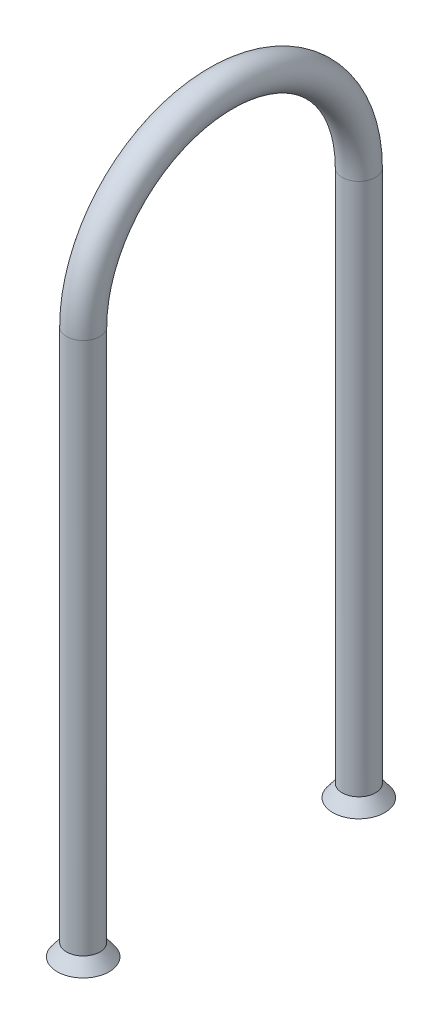
ISO-10303-21;
HEADER;
FILE_DESCRIPTION(('STEP AP214'),'2;1');
FILE_NAME('part.step','',(''),(''),'','','');
FILE_SCHEMA(('AUTOMOTIVE_DESIGN { 1 0 10303 214 1 1 1 1 }'));
ENDSEC;
DATA;
#1=APPLICATION_CONTEXT('core data for automotive mechanical design processes');
#2=APPLICATION_PROTOCOL_DEFINITION('international standard','automotive_design',2000,#1);
#3=PRODUCT_CONTEXT('',#1,'mechanical');
#4=PRODUCT('Part','Part','',(#3));
#5=PRODUCT_RELATED_PRODUCT_CATEGORY('part','',(#4));
#6=PRODUCT_DEFINITION_FORMATION('','',#4);
#7=PRODUCT_DEFINITION_CONTEXT('part definition',#1,'design');
#8=PRODUCT_DEFINITION('design','',#6,#7);
#9=PRODUCT_DEFINITION_SHAPE('','',#8);
#10=(LENGTH_UNIT() NAMED_UNIT(*) SI_UNIT(.MILLI.,.METRE.));
#11=(NAMED_UNIT(*) PLANE_ANGLE_UNIT() SI_UNIT($,.RADIAN.));
#12=(NAMED_UNIT(*) SI_UNIT($,.STERADIAN.) SOLID_ANGLE_UNIT());
#13=UNCERTAINTY_MEASURE_WITH_UNIT(LENGTH_MEASURE(1.E-05),#10,'distance_accuracy_value','');
#14=(GEOMETRIC_REPRESENTATION_CONTEXT(3) GLOBAL_UNCERTAINTY_ASSIGNED_CONTEXT((#13)) GLOBAL_UNIT_ASSIGNED_CONTEXT((#10,
#11,#12)) REPRESENTATION_CONTEXT('',''));
#15=CARTESIAN_POINT('',(0.,0.,0.));
#16=DIRECTION('',(0.,0.,1.));
#17=DIRECTION('',(1.,0.,0.));
#18=AXIS2_PLACEMENT_3D('',#15,#16,#17);
#19=CARTESIAN_POINT('',(0.,-97.680223994,-19.702223994));
#20=DIRECTION('',(0.,-1.,0.));
#21=DIRECTION('',(0.,0.,1.));
#22=AXIS2_PLACEMENT_3D('',#19,#20,#21);
#23=PLANE('',#22);
#24=CARTESIAN_POINT('',(0.,-97.680223994,-19.702223994));
#25=DIRECTION('',(0.,-1.,0.));
#26=DIRECTION('',(0.,0.,-1.));
#27=AXIS2_PLACEMENT_3D('',#24,#25,#26);
#28=CIRCLE('',#27,3.72106910108277);
#29=CARTESIAN_POINT('',(0.,-97.680223994,-23.4232930950828));
#30=VERTEX_POINT('',#29);
#31=EDGE_CURVE('E77',#30,#30,#28,.F.);
#32=ORIENTED_EDGE('',*,*,#31,.F.);
#33=EDGE_LOOP('',(#32));
#34=FACE_BOUND('',#33,.T.);
#35=CARTESIAN_POINT('',(0.,-97.680223994,-19.702223994));
#36=DIRECTION('',(0.,1.,0.));
#37=DIRECTION('',(0.,0.,1.));
#38=AXIS2_PLACEMENT_3D('',#35,#36,#37);
#39=CIRCLE('',#38,3.16226910108277);
#40=CARTESIAN_POINT('',(0.,-97.680223994,-16.5399548929172));
#41=VERTEX_POINT('',#40);
#42=EDGE_CURVE('E83',#41,#41,#39,.F.);
#43=ORIENTED_EDGE('',*,*,#42,.F.);
#44=EDGE_LOOP('',(#43));
#45=FACE_BOUND('',#44,.T.);
#46=ADVANCED_FACE('F39',(#34,#45),#23,.T.);
#47=CARTESIAN_POINT('',(0.,-19.702223994,19.702223994));
#48=DIRECTION('',(0.,-1.,0.));
#49=DIRECTION('',(0.,0.,-1.));
#50=AXIS2_PLACEMENT_3D('',#47,#48,#49);
#51=CYLINDRICAL_SURFACE('',#50,2.38125);
#52=CARTESIAN_POINT('',(0.,-19.702223994,19.702223994));
#53=DIRECTION('',(0.,-1.,0.));
#54=DIRECTION('',(1.,0.,0.));
#55=AXIS2_PLACEMENT_3D('',#52,#53,#54);
#56=CIRCLE('',#55,2.38125);
#57=CARTESIAN_POINT('',(0.,-19.702223994,22.083473994));
#58=VERTEX_POINT('',#57);
#59=EDGE_CURVE('E47',#58,#58,#56,.T.);
#60=ORIENTED_EDGE('',*,*,#59,.T.);
#61=EDGE_LOOP('',(#60));
#62=FACE_BOUND('',#61,.T.);
#63=CARTESIAN_POINT('',(0.,-95.902223994,19.702223994));
#64=DIRECTION('',(0.,-1.,0.));
#65=DIRECTION('',(1.,0.,0.));
#66=AXIS2_PLACEMENT_3D('',#63,#64,#65);
#67=CIRCLE('',#66,2.38125);
#68=CARTESIAN_POINT('',(2.38125,-95.902223994,19.702223994));
#69=VERTEX_POINT('',#68);
#70=EDGE_CURVE('E10',#69,#69,#67,.T.);
#71=ORIENTED_EDGE('',*,*,#70,.F.);
#72=EDGE_LOOP('',(#71));
#73=FACE_BOUND('',#72,.T.);
#74=ADVANCED_FACE('F41',(#62,#73),#51,.T.);
#75=CARTESIAN_POINT('',(0.,-19.702223994,19.702223994));
#76=DIRECTION('',(0.,-1.,0.));
#77=DIRECTION('',(0.,0.,-1.));
#78=AXIS2_PLACEMENT_3D('',#75,#76,#77);
#79=CYLINDRICAL_SURFACE('',#78,1.82245);
#80=CARTESIAN_POINT('',(0.,-19.702223994,19.702223994));
#81=DIRECTION('',(0.,-1.,0.));
#82=DIRECTION('',(1.,0.,0.));
#83=AXIS2_PLACEMENT_3D('',#80,#81,#82);
#84=CIRCLE('',#83,1.82245);
#85=CARTESIAN_POINT('',(0.,-19.702223994,21.524673994));
#86=VERTEX_POINT('',#85);
#87=EDGE_CURVE('E53',#86,#86,#84,.T.);
#88=ORIENTED_EDGE('',*,*,#87,.F.);
#89=EDGE_LOOP('',(#88));
#90=FACE_BOUND('',#89,.T.);
#91=CARTESIAN_POINT('',(0.,-95.902223994,19.702223994));
#92=DIRECTION('',(0.,1.,0.));
#93=DIRECTION('',(0.,0.,1.));
#94=AXIS2_PLACEMENT_3D('',#91,#92,#93);
#95=CIRCLE('',#94,1.82245);
#96=CARTESIAN_POINT('',(0.,-95.902223994,21.524673994));
#97=VERTEX_POINT('',#96);
#98=EDGE_CURVE('E68',#97,#97,#95,.T.);
#99=ORIENTED_EDGE('',*,*,#98,.F.);
#100=EDGE_LOOP('',(#99));
#101=FACE_BOUND('',#100,.T.);
#102=ADVANCED_FACE('F108',(#90,#101),#79,.F.);
#103=CARTESIAN_POINT('',(0.,-19.702223994,0.));
#104=DIRECTION('',(-1.,0.,0.));
#105=DIRECTION('',(0.,0.,1.));
#106=AXIS2_PLACEMENT_3D('',#103,#104,#105);
#107=TOROIDAL_SURFACE('',#106,19.702223994,1.82245);
#108=CARTESIAN_POINT('',(0.,-19.702223994,-19.702223994));
#109=DIRECTION('',(0.,1.,0.));
#110=DIRECTION('',(1.,0.,0.));
#111=AXIS2_PLACEMENT_3D('',#108,#109,#110);
#112=CIRCLE('',#111,1.82245);
#113=CARTESIAN_POINT('',(0.,-19.702223994,-21.524673994));
#114=VERTEX_POINT('',#113);
#115=EDGE_CURVE('E74',#114,#114,#112,.T.);
#116=CARTESIAN_POINT('',(0.,-19.702223994,0.));
#117=DIRECTION('',(-1.,0.,0.));
#118=DIRECTION('',(0.,0.,1.));
#119=AXIS2_PLACEMENT_3D('',#116,#117,#118);
#120=CIRCLE('',#119,21.524673994);
#121=EDGE_CURVE('',#86,#114,#120,.T.);
#122=ORIENTED_EDGE('',*,*,#87,.T.);
#123=ORIENTED_EDGE('',*,*,#115,.F.);
#124=ORIENTED_EDGE('',*,*,#121,.T.);
#125=ORIENTED_EDGE('',*,*,#121,.F.);
#126=EDGE_LOOP('',(#122,#124,#123,#125));
#127=FACE_BOUND('',#126,.T.);
#128=ADVANCED_FACE('F132',(#127),#107,.F.);
#129=CARTESIAN_POINT('',(0.,-19.702223994,0.));
#130=DIRECTION('',(-1.,0.,0.));
#131=DIRECTION('',(0.,0.,1.));
#132=AXIS2_PLACEMENT_3D('',#129,#130,#131);
#133=TOROIDAL_SURFACE('',#132,19.702223994,2.38125);
#134=CARTESIAN_POINT('',(0.,-19.702223994,-19.702223994));
#135=DIRECTION('',(0.,1.,0.));
#136=DIRECTION('',(1.,0.,0.));
#137=AXIS2_PLACEMENT_3D('',#134,#135,#136);
#138=CIRCLE('',#137,2.38125);
#139=CARTESIAN_POINT('',(0.,-19.702223994,-22.083473994));
#140=VERTEX_POINT('',#139);
#141=EDGE_CURVE('E71',#140,#140,#138,.T.);
#142=CARTESIAN_POINT('',(0.,-19.702223994,0.));
#143=DIRECTION('',(-1.,0.,0.));
#144=DIRECTION('',(0.,0.,1.));
#145=AXIS2_PLACEMENT_3D('',#142,#143,#144);
#146=CIRCLE('',#145,22.083473994);
#147=EDGE_CURVE('',#58,#140,#146,.T.);
#148=ORIENTED_EDGE('',*,*,#59,.F.);
#149=ORIENTED_EDGE('',*,*,#141,.T.);
#150=ORIENTED_EDGE('',*,*,#147,.T.);
#151=ORIENTED_EDGE('',*,*,#147,.F.);
#152=EDGE_LOOP('',(#148,#150,#149,#151));
#153=FACE_BOUND('',#152,.T.);
#154=ADVANCED_FACE('F127',(#153),#133,.T.);
#155=CARTESIAN_POINT('',(0.,-97.680223994,19.702223994));
#156=DIRECTION('',(0.,-1.,0.));
#157=DIRECTION('',(0.,0.,-1.));
#158=AXIS2_PLACEMENT_3D('',#155,#156,#157);
#159=PLANE('',#158);
#160=CARTESIAN_POINT('',(0.,-97.680223994,19.702223994));
#161=DIRECTION('',(0.,1.,0.));
#162=DIRECTION('',(0.,0.,1.));
#163=AXIS2_PLACEMENT_3D('',#160,#161,#162);
#164=CIRCLE('',#163,3.16226910108277);
#165=CARTESIAN_POINT('',(0.,-97.680223994,22.8644930950828));
#166=VERTEX_POINT('',#165);
#167=EDGE_CURVE('E64',#166,#166,#164,.T.);
#168=ORIENTED_EDGE('',*,*,#167,.T.);
#169=EDGE_LOOP('',(#168));
#170=FACE_BOUND('',#169,.T.);
#171=CARTESIAN_POINT('',(0.,-97.680223994,19.702223994));
#172=DIRECTION('',(0.,-1.,0.));
#173=DIRECTION('',(0.,0.,-1.));
#174=AXIS2_PLACEMENT_3D('',#171,#172,#173);
#175=CIRCLE('',#174,3.72106910108277);
#176=CARTESIAN_POINT('',(0.,-97.680223994,15.9811548929172));
#177=VERTEX_POINT('',#176);
#178=EDGE_CURVE('E58',#177,#177,#175,.T.);
#179=ORIENTED_EDGE('',*,*,#178,.T.);
#180=EDGE_LOOP('',(#179));
#181=FACE_BOUND('',#180,.T.);
#182=ADVANCED_FACE('F124',(#170,#181),#159,.T.);
#183=CARTESIAN_POINT('',(0.,-95.902223994,19.702223994));
#184=DIRECTION('',(0.,-1.,0.));
#185=DIRECTION('',(0.,0.,-1.));
#186=AXIS2_PLACEMENT_3D('',#183,#184,#185);
#187=CONICAL_SURFACE('',#186,2.38125,0.645771823237903);
#188=ORIENTED_EDGE('',*,*,#178,.F.);
#189=EDGE_LOOP('',(#188));
#190=FACE_BOUND('',#189,.T.);
#191=ORIENTED_EDGE('',*,*,#70,.T.);
#192=EDGE_LOOP('',(#191));
#193=FACE_BOUND('',#192,.T.);
#194=ADVANCED_FACE('F122',(#190,#193),#187,.T.);
#195=CARTESIAN_POINT('',(0.,-95.902223994,19.702223994));
#196=DIRECTION('',(0.,-1.,0.));
#197=DIRECTION('',(0.,0.,1.));
#198=AXIS2_PLACEMENT_3D('',#195,#196,#197);
#199=CONICAL_SURFACE('',#198,1.82245,0.645771823237903);
#200=ORIENTED_EDGE('',*,*,#167,.F.);
#201=EDGE_LOOP('',(#200));
#202=FACE_BOUND('',#201,.T.);
#203=ORIENTED_EDGE('',*,*,#98,.T.);
#204=EDGE_LOOP('',(#203));
#205=FACE_BOUND('',#204,.T.);
#206=ADVANCED_FACE('F118',(#202,#205),#199,.F.);
#207=CARTESIAN_POINT('',(0.,-19.702223994,-19.702223994));
#208=DIRECTION('',(0.,-1.,0.));
#209=DIRECTION('',(0.,0.,-1.));
#210=AXIS2_PLACEMENT_3D('',#207,#208,#209);
#211=CYLINDRICAL_SURFACE('',#210,2.38125);
#212=ORIENTED_EDGE('',*,*,#141,.F.);
#213=EDGE_LOOP('',(#212));
#214=FACE_BOUND('',#213,.T.);
#215=CARTESIAN_POINT('',(0.,-95.902223994,-19.702223994));
#216=DIRECTION('',(0.,1.,0.));
#217=DIRECTION('',(0.,0.,1.));
#218=AXIS2_PLACEMENT_3D('',#215,#216,#217);
#219=CIRCLE('',#218,2.38125);
#220=CARTESIAN_POINT('',(0.,-95.902223994,-17.320973994));
#221=VERTEX_POINT('',#220);
#222=EDGE_CURVE('E80',#221,#221,#219,.T.);
#223=ORIENTED_EDGE('',*,*,#222,.T.);
#224=EDGE_LOOP('',(#223));
#225=FACE_BOUND('',#224,.T.);
#226=ADVANCED_FACE('F114',(#214,#225),#211,.T.);
#227=CARTESIAN_POINT('',(0.,-19.702223994,-19.702223994));
#228=DIRECTION('',(0.,-1.,0.));
#229=DIRECTION('',(0.,0.,-1.));
#230=AXIS2_PLACEMENT_3D('',#227,#228,#229);
#231=CYLINDRICAL_SURFACE('',#230,1.82245);
#232=ORIENTED_EDGE('',*,*,#115,.T.);
#233=EDGE_LOOP('',(#232));
#234=FACE_BOUND('',#233,.T.);
#235=CARTESIAN_POINT('',(0.,-95.902223994,-19.702223994));
#236=DIRECTION('',(0.,-1.,0.));
#237=DIRECTION('',(0.,0.,-1.));
#238=AXIS2_PLACEMENT_3D('',#235,#236,#237);
#239=CIRCLE('',#238,1.82245);
#240=CARTESIAN_POINT('',(0.,-95.902223994,-21.524673994));
#241=VERTEX_POINT('',#240);
#242=EDGE_CURVE('E86',#241,#241,#239,.T.);
#243=ORIENTED_EDGE('',*,*,#242,.T.);
#244=EDGE_LOOP('',(#243));
#245=FACE_BOUND('',#244,.T.);
#246=ADVANCED_FACE('F90',(#234,#245),#231,.F.);
#247=CARTESIAN_POINT('',(0.,-95.902223994,-19.702223994));
#248=DIRECTION('',(0.,-1.,0.));
#249=DIRECTION('',(0.,0.,1.));
#250=AXIS2_PLACEMENT_3D('',#247,#248,#249);
#251=CONICAL_SURFACE('',#250,2.38125,0.645771823237903);
#252=ORIENTED_EDGE('',*,*,#31,.T.);
#253=EDGE_LOOP('',(#252));
#254=FACE_BOUND('',#253,.T.);
#255=ORIENTED_EDGE('',*,*,#222,.F.);
#256=EDGE_LOOP('',(#255));
#257=FACE_BOUND('',#256,.T.);
#258=ADVANCED_FACE('F94',(#254,#257),#251,.T.);
#259=CARTESIAN_POINT('',(0.,-95.902223994,-19.702223994));
#260=DIRECTION('',(0.,-1.,0.));
#261=DIRECTION('',(0.,0.,-1.));
#262=AXIS2_PLACEMENT_3D('',#259,#260,#261);
#263=CONICAL_SURFACE('',#262,1.82245,0.645771823237903);
#264=ORIENTED_EDGE('',*,*,#42,.T.);
#265=EDGE_LOOP('',(#264));
#266=FACE_BOUND('',#265,.T.);
#267=ORIENTED_EDGE('',*,*,#242,.F.);
#268=EDGE_LOOP('',(#267));
#269=FACE_BOUND('',#268,.T.);
#270=ADVANCED_FACE('F92',(#266,#269),#263,.F.);
#271=CLOSED_SHELL('',(#46,#74,#102,#128,#154,#182,#194,#206,#226,#246,#258,#270));
#272=MANIFOLD_SOLID_BREP('B2',#271);
#273=ADVANCED_BREP_SHAPE_REPRESENTATION('',(#18,#272),#14);
#274=SHAPE_DEFINITION_REPRESENTATION(#9,#273);
ENDSEC;
END-ISO-10303-21;
